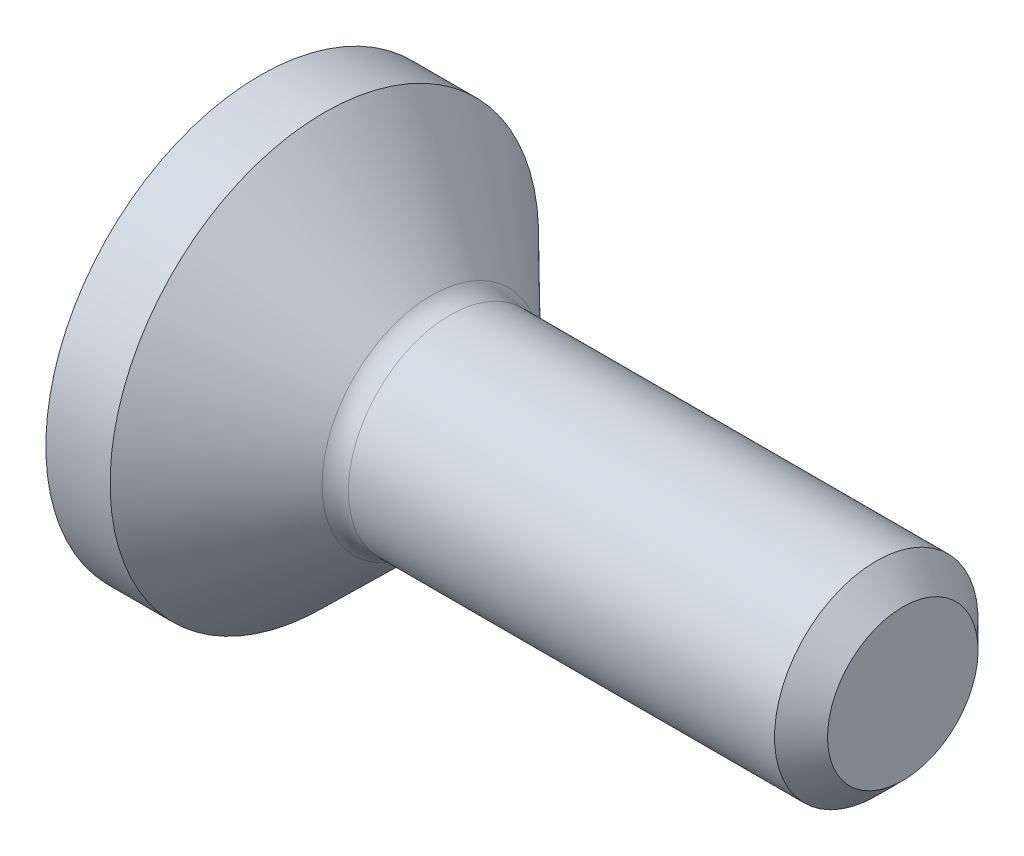
ISO-10303-21;
HEADER;
FILE_DESCRIPTION(('STEP AP214'),'2;1');
FILE_NAME('part.step','',(''),(''),'','','');
FILE_SCHEMA(('AUTOMOTIVE_DESIGN { 1 0 10303 214 1 1 1 1 }'));
ENDSEC;
DATA;
#1=APPLICATION_CONTEXT('core data for automotive mechanical design processes');
#2=APPLICATION_PROTOCOL_DEFINITION('international standard','automotive_design',2000,#1);
#3=PRODUCT_CONTEXT('',#1,'mechanical');
#4=PRODUCT('Part','Part','',(#3));
#5=PRODUCT_RELATED_PRODUCT_CATEGORY('part','',(#4));
#6=PRODUCT_DEFINITION_FORMATION('','',#4);
#7=PRODUCT_DEFINITION_CONTEXT('part definition',#1,'design');
#8=PRODUCT_DEFINITION('design','',#6,#7);
#9=PRODUCT_DEFINITION_SHAPE('','',#8);
#10=(LENGTH_UNIT() NAMED_UNIT(*) SI_UNIT(.MILLI.,.METRE.));
#11=(NAMED_UNIT(*) PLANE_ANGLE_UNIT() SI_UNIT($,.RADIAN.));
#12=(NAMED_UNIT(*) SI_UNIT($,.STERADIAN.) SOLID_ANGLE_UNIT());
#13=UNCERTAINTY_MEASURE_WITH_UNIT(LENGTH_MEASURE(1.E-05),#10,'distance_accuracy_value','');
#14=(GEOMETRIC_REPRESENTATION_CONTEXT(3) GLOBAL_UNCERTAINTY_ASSIGNED_CONTEXT((#13)) GLOBAL_UNIT_ASSIGNED_CONTEXT((#10,
#11,#12)) REPRESENTATION_CONTEXT('',''));
#15=CARTESIAN_POINT('',(0.,0.,0.));
#16=DIRECTION('',(0.,0.,1.));
#17=DIRECTION('',(1.,0.,0.));
#18=AXIS2_PLACEMENT_3D('',#15,#16,#17);
#19=CARTESIAN_POINT('',(1.77486105262841,0.,0.));
#20=DIRECTION('',(1.,0.,0.));
#21=DIRECTION('',(0.,1.,0.));
#22=AXIS2_PLACEMENT_3D('',#19,#20,#21);
#23=TOROIDAL_SURFACE('',#22,1.2,0.250000000000001);
#24=CARTESIAN_POINT('',(1.6,0.,0.));
#25=DIRECTION('',(1.,0.,0.));
#26=DIRECTION('',(0.,1.,0.));
#27=AXIS2_PLACEMENT_3D('',#24,#25,#26);
#28=CIRCLE('',#27,1.0213281995566);
#29=CARTESIAN_POINT('',(1.6,1.0213281995566,0.));
#30=VERTEX_POINT('',#29);
#31=EDGE_CURVE('E134',#30,#30,#28,.T.);
#32=ORIENTED_EDGE('',*,*,#31,.T.);
#33=EDGE_LOOP('',(#32));
#34=FACE_BOUND('',#33,.T.);
#35=CARTESIAN_POINT('',(1.77486105262841,0.,0.));
#36=DIRECTION('',(1.,0.,0.));
#37=DIRECTION('',(0.,1.,0.));
#38=AXIS2_PLACEMENT_3D('',#35,#36,#37);
#39=CIRCLE('',#38,0.950000000000001);
#40=CARTESIAN_POINT('',(1.77486105262841,0.950000000000001,0.));
#41=VERTEX_POINT('',#40);
#42=EDGE_CURVE('E11',#41,#41,#39,.T.);
#43=ORIENTED_EDGE('',*,*,#42,.F.);
#44=EDGE_LOOP('',(#43));
#45=FACE_BOUND('',#44,.T.);
#46=ADVANCED_FACE('F33',(#34,#45),#23,.F.);
#47=CARTESIAN_POINT('',(0.,0.,0.));
#48=DIRECTION('',(1.,0.,0.));
#49=DIRECTION('',(0.,1.,0.));
#50=AXIS2_PLACEMENT_3D('',#47,#48,#49);
#51=CYLINDRICAL_SURFACE('',#50,0.950000000000001);
#52=ORIENTED_EDGE('',*,*,#42,.T.);
#53=EDGE_LOOP('',(#52));
#54=FACE_BOUND('',#53,.T.);
#55=CARTESIAN_POINT('',(5.75251262658471,0.,0.));
#56=DIRECTION('',(1.,0.,0.));
#57=DIRECTION('',(0.,1.,0.));
#58=AXIS2_PLACEMENT_3D('',#55,#56,#57);
#59=CIRCLE('',#58,0.950000000000001);
#60=CARTESIAN_POINT('',(5.75251262658471,0.950000000000001,0.));
#61=VERTEX_POINT('',#60);
#62=EDGE_CURVE('E40',#61,#61,#59,.T.);
#63=ORIENTED_EDGE('',*,*,#62,.F.);
#64=EDGE_LOOP('',(#63));
#65=FACE_BOUND('',#64,.T.);
#66=ADVANCED_FACE('F156',(#54,#65),#51,.T.);
#67=CARTESIAN_POINT('',(6.,0.,0.));
#68=DIRECTION('',(-1.,0.,0.));
#69=DIRECTION('',(0.,-1.,0.));
#70=AXIS2_PLACEMENT_3D('',#67,#68,#69);
#71=CONICAL_SURFACE('',#70,0.702512626584708,0.785398163397451);
#72=ORIENTED_EDGE('',*,*,#62,.T.);
#73=EDGE_LOOP('',(#72));
#74=FACE_BOUND('',#73,.T.);
#75=CARTESIAN_POINT('',(6.,0.,0.));
#76=DIRECTION('',(1.,0.,0.));
#77=DIRECTION('',(0.,1.,0.));
#78=AXIS2_PLACEMENT_3D('',#75,#76,#77);
#79=CIRCLE('',#78,0.702512626584708);
#80=CARTESIAN_POINT('',(6.,0.702512626584708,0.));
#81=VERTEX_POINT('',#80);
#82=EDGE_CURVE('E148',#81,#81,#79,.T.);
#83=ORIENTED_EDGE('',*,*,#82,.F.);
#84=EDGE_LOOP('',(#83));
#85=FACE_BOUND('',#84,.T.);
#86=ADVANCED_FACE('F153',(#74,#85),#71,.T.);
#87=CARTESIAN_POINT('',(6.,0.702512626584708,0.));
#88=DIRECTION('',(1.,0.,0.));
#89=DIRECTION('',(0.,1.,0.));
#90=AXIS2_PLACEMENT_3D('',#87,#88,#89);
#91=PLANE('',#90);
#92=ORIENTED_EDGE('',*,*,#82,.T.);
#93=EDGE_LOOP('',(#92));
#94=FACE_BOUND('',#93,.T.);
#95=ADVANCED_FACE('F163',(#94),#91,.T.);
#96=CARTESIAN_POINT('',(0.,2.,0.));
#97=DIRECTION('',(-1.,0.,0.));
#98=DIRECTION('',(0.,-1.,0.));
#99=AXIS2_PLACEMENT_3D('',#96,#97,#98);
#100=PLANE('',#99);
#101=DIRECTION('',(0.,1.,0.));
#102=VECTOR('',#101,1.);
#103=CARTESIAN_POINT('',(0.,-0.43301270189222,0.75));
#104=LINE('',#103,#102);
#105=CARTESIAN_POINT('',(0.,-0.43301270189222,0.75));
#106=VERTEX_POINT('',#105);
#107=CARTESIAN_POINT('',(0.,0.43301270189222,0.75));
#108=VERTEX_POINT('',#107);
#109=EDGE_CURVE('E47',#106,#108,#104,.T.);
#110=ORIENTED_EDGE('',*,*,#109,.F.);
#111=DIRECTION('',(0.,0.5,0.866025403784439));
#112=VECTOR('',#111,1.);
#113=CARTESIAN_POINT('',(0.,-0.866025403784439,0.));
#114=LINE('',#113,#112);
#115=CARTESIAN_POINT('',(0.,-0.866025403784439,0.));
#116=VERTEX_POINT('',#115);
#117=EDGE_CURVE('E130',#116,#106,#114,.T.);
#118=ORIENTED_EDGE('',*,*,#117,.F.);
#119=DIRECTION('',(0.,-0.5,0.866025403784439));
#120=VECTOR('',#119,1.);
#121=CARTESIAN_POINT('',(0.,-0.43301270189222,-0.75));
#122=LINE('',#121,#120);
#123=CARTESIAN_POINT('',(0.,-0.43301270189222,-0.75));
#124=VERTEX_POINT('',#123);
#125=EDGE_CURVE('E128',#124,#116,#122,.T.);
#126=ORIENTED_EDGE('',*,*,#125,.F.);
#127=DIRECTION('',(0.,-1.,0.));
#128=VECTOR('',#127,1.);
#129=CARTESIAN_POINT('',(0.,0.43301270189222,-0.75));
#130=LINE('',#129,#128);
#131=CARTESIAN_POINT('',(0.,0.43301270189222,-0.75));
#132=VERTEX_POINT('',#131);
#133=EDGE_CURVE('E95',#132,#124,#130,.T.);
#134=ORIENTED_EDGE('',*,*,#133,.F.);
#135=DIRECTION('',(0.,-0.5,-0.866025403784439));
#136=VECTOR('',#135,1.);
#137=CARTESIAN_POINT('',(0.,0.866025403784439,0.));
#138=LINE('',#137,#136);
#139=CARTESIAN_POINT('',(0.,0.866025403784439,0.));
#140=VERTEX_POINT('',#139);
#141=EDGE_CURVE('E124',#140,#132,#138,.T.);
#142=ORIENTED_EDGE('',*,*,#141,.F.);
#143=DIRECTION('',(0.,0.5,-0.866025403784439));
#144=VECTOR('',#143,1.);
#145=CARTESIAN_POINT('',(0.,0.433012701892219,0.75));
#146=LINE('',#145,#144);
#147=EDGE_CURVE('E121',#108,#140,#146,.T.);
#148=ORIENTED_EDGE('',*,*,#147,.F.);
#149=EDGE_LOOP('',(#110,#118,#126,#134,#142,#148));
#150=FACE_BOUND('',#149,.T.);
#151=CARTESIAN_POINT('',(0.,0.,0.));
#152=DIRECTION('',(1.,0.,0.));
#153=DIRECTION('',(0.,1.,0.));
#154=AXIS2_PLACEMENT_3D('',#151,#152,#153);
#155=CIRCLE('',#154,2.);
#156=CARTESIAN_POINT('',(0.,2.,0.));
#157=VERTEX_POINT('',#156);
#158=EDGE_CURVE('E145',#157,#157,#155,.T.);
#159=ORIENTED_EDGE('',*,*,#158,.F.);
#160=EDGE_LOOP('',(#159));
#161=FACE_BOUND('',#160,.T.);
#162=ADVANCED_FACE('F169',(#150,#161),#100,.T.);
#163=CARTESIAN_POINT('',(0.,0.,0.));
#164=DIRECTION('',(1.,0.,0.));
#165=DIRECTION('',(0.,1.,0.));
#166=AXIS2_PLACEMENT_3D('',#163,#164,#165);
#167=CYLINDRICAL_SURFACE('',#166,2.);
#168=ORIENTED_EDGE('',*,*,#158,.T.);
#169=EDGE_LOOP('',(#168));
#170=FACE_BOUND('',#169,.T.);
#171=CARTESIAN_POINT('',(0.6,0.,0.));
#172=DIRECTION('',(1.,0.,0.));
#173=DIRECTION('',(0.,1.,0.));
#174=AXIS2_PLACEMENT_3D('',#171,#172,#173);
#175=CIRCLE('',#174,2.);
#176=CARTESIAN_POINT('',(0.6,2.,0.));
#177=VERTEX_POINT('',#176);
#178=EDGE_CURVE('E142',#177,#177,#175,.T.);
#179=ORIENTED_EDGE('',*,*,#178,.F.);
#180=EDGE_LOOP('',(#179));
#181=FACE_BOUND('',#180,.T.);
#182=ADVANCED_FACE('F173',(#170,#181),#167,.T.);
#183=CARTESIAN_POINT('',(1.6,0.,0.));
#184=DIRECTION('',(-1.,0.,0.));
#185=DIRECTION('',(0.,-1.,0.));
#186=AXIS2_PLACEMENT_3D('',#183,#184,#185);
#187=CONICAL_SURFACE('',#186,1.0213281995566,0.77461953220493);
#188=ORIENTED_EDGE('',*,*,#178,.T.);
#189=EDGE_LOOP('',(#188));
#190=FACE_BOUND('',#189,.T.);
#191=ORIENTED_EDGE('',*,*,#31,.F.);
#192=EDGE_LOOP('',(#191));
#193=FACE_BOUND('',#192,.T.);
#194=ADVANCED_FACE('F177',(#190,#193),#187,.T.);
#195=CARTESIAN_POINT('',(1.5,-0.43301270189222,0.75));
#196=DIRECTION('',(0.,0.,1.));
#197=DIRECTION('',(0.,-1.,0.));
#198=AXIS2_PLACEMENT_3D('',#195,#196,#197);
#199=PLANE('',#198);
#200=ORIENTED_EDGE('',*,*,#109,.T.);
#201=DIRECTION('',(-1.,0.,0.));
#202=VECTOR('',#201,1.);
#203=CARTESIAN_POINT('',(1.5,0.433012701892219,0.75));
#204=LINE('',#203,#202);
#205=CARTESIAN_POINT('',(1.5,0.433012701892219,0.75));
#206=VERTEX_POINT('',#205);
#207=EDGE_CURVE('E77',#206,#108,#204,.T.);
#208=ORIENTED_EDGE('',*,*,#207,.F.);
#209=DIRECTION('',(0.,1.,0.));
#210=VECTOR('',#209,1.);
#211=CARTESIAN_POINT('',(1.5,-0.43301270189222,0.75));
#212=LINE('',#211,#210);
#213=CARTESIAN_POINT('',(1.5,-0.43301270189222,0.75));
#214=VERTEX_POINT('',#213);
#215=EDGE_CURVE('E132',#214,#206,#212,.T.);
#216=ORIENTED_EDGE('',*,*,#215,.F.);
#217=DIRECTION('',(-1.,0.,0.));
#218=VECTOR('',#217,1.);
#219=CARTESIAN_POINT('',(1.5,-0.43301270189222,0.75));
#220=LINE('',#219,#218);
#221=EDGE_CURVE('E55',#214,#106,#220,.T.);
#222=ORIENTED_EDGE('',*,*,#221,.T.);
#223=EDGE_LOOP('',(#200,#208,#216,#222));
#224=FACE_BOUND('',#223,.T.);
#225=ADVANCED_FACE('F181',(#224),#199,.F.);
#226=CARTESIAN_POINT('',(1.5,-0.866025403784439,0.));
#227=DIRECTION('',(0.,-0.866025403784439,0.5));
#228=DIRECTION('',(0.,-0.5,-0.866025403784439));
#229=AXIS2_PLACEMENT_3D('',#226,#227,#228);
#230=PLANE('',#229);
#231=ORIENTED_EDGE('',*,*,#117,.T.);
#232=ORIENTED_EDGE('',*,*,#221,.F.);
#233=DIRECTION('',(0.,0.5,0.866025403784439));
#234=VECTOR('',#233,1.);
#235=CARTESIAN_POINT('',(1.5,-0.866025403784439,0.));
#236=LINE('',#235,#234);
#237=CARTESIAN_POINT('',(1.5,-0.866025403784439,0.));
#238=VERTEX_POINT('',#237);
#239=EDGE_CURVE('E107',#238,#214,#236,.T.);
#240=ORIENTED_EDGE('',*,*,#239,.F.);
#241=DIRECTION('',(-1.,0.,0.));
#242=VECTOR('',#241,1.);
#243=CARTESIAN_POINT('',(1.5,-0.866025403784439,0.));
#244=LINE('',#243,#242);
#245=EDGE_CURVE('E99',#238,#116,#244,.T.);
#246=ORIENTED_EDGE('',*,*,#245,.T.);
#247=EDGE_LOOP('',(#231,#232,#240,#246));
#248=FACE_BOUND('',#247,.T.);
#249=ADVANCED_FACE('F185',(#248),#230,.F.);
#250=CARTESIAN_POINT('',(1.5,-0.43301270189222,-0.75));
#251=DIRECTION('',(0.,-0.866025403784439,-0.5));
#252=DIRECTION('',(0.,0.5,-0.866025403784439));
#253=AXIS2_PLACEMENT_3D('',#250,#251,#252);
#254=PLANE('',#253);
#255=ORIENTED_EDGE('',*,*,#125,.T.);
#256=ORIENTED_EDGE('',*,*,#245,.F.);
#257=DIRECTION('',(0.,-0.5,0.866025403784439));
#258=VECTOR('',#257,1.);
#259=CARTESIAN_POINT('',(1.5,-0.43301270189222,-0.75));
#260=LINE('',#259,#258);
#261=CARTESIAN_POINT('',(1.5,-0.43301270189222,-0.75));
#262=VERTEX_POINT('',#261);
#263=EDGE_CURVE('E103',#262,#238,#260,.T.);
#264=ORIENTED_EDGE('',*,*,#263,.F.);
#265=DIRECTION('',(-1.,0.,0.));
#266=VECTOR('',#265,1.);
#267=CARTESIAN_POINT('',(1.5,-0.43301270189222,-0.75));
#268=LINE('',#267,#266);
#269=EDGE_CURVE('E88',#262,#124,#268,.T.);
#270=ORIENTED_EDGE('',*,*,#269,.T.);
#271=EDGE_LOOP('',(#255,#256,#264,#270));
#272=FACE_BOUND('',#271,.T.);
#273=ADVANCED_FACE('F104',(#272),#254,.F.);
#274=CARTESIAN_POINT('',(1.5,0.43301270189222,-0.75));
#275=DIRECTION('',(0.,0.,-1.));
#276=DIRECTION('',(0.,1.,0.));
#277=AXIS2_PLACEMENT_3D('',#274,#275,#276);
#278=PLANE('',#277);
#279=ORIENTED_EDGE('',*,*,#133,.T.);
#280=ORIENTED_EDGE('',*,*,#269,.F.);
#281=DIRECTION('',(0.,-1.,0.));
#282=VECTOR('',#281,1.);
#283=CARTESIAN_POINT('',(1.5,0.43301270189222,-0.75));
#284=LINE('',#283,#282);
#285=CARTESIAN_POINT('',(1.5,0.43301270189222,-0.75));
#286=VERTEX_POINT('',#285);
#287=EDGE_CURVE('E92',#286,#262,#284,.T.);
#288=ORIENTED_EDGE('',*,*,#287,.F.);
#289=DIRECTION('',(-1.,0.,0.));
#290=VECTOR('',#289,1.);
#291=CARTESIAN_POINT('',(1.5,0.43301270189222,-0.75));
#292=LINE('',#291,#290);
#293=EDGE_CURVE('E100',#286,#132,#292,.T.);
#294=ORIENTED_EDGE('',*,*,#293,.T.);
#295=EDGE_LOOP('',(#279,#280,#288,#294));
#296=FACE_BOUND('',#295,.T.);
#297=ADVANCED_FACE('F90',(#296),#278,.F.);
#298=CARTESIAN_POINT('',(1.5,0.866025403784439,0.));
#299=DIRECTION('',(0.,0.866025403784439,-0.5));
#300=DIRECTION('',(0.,0.5,0.866025403784439));
#301=AXIS2_PLACEMENT_3D('',#298,#299,#300);
#302=PLANE('',#301);
#303=ORIENTED_EDGE('',*,*,#141,.T.);
#304=ORIENTED_EDGE('',*,*,#293,.F.);
#305=DIRECTION('',(0.,-0.5,-0.866025403784439));
#306=VECTOR('',#305,1.);
#307=CARTESIAN_POINT('',(1.5,0.866025403784439,0.));
#308=LINE('',#307,#306);
#309=CARTESIAN_POINT('',(1.5,0.866025403784439,0.));
#310=VERTEX_POINT('',#309);
#311=EDGE_CURVE('E113',#310,#286,#308,.T.);
#312=ORIENTED_EDGE('',*,*,#311,.F.);
#313=DIRECTION('',(-1.,0.,0.));
#314=VECTOR('',#313,1.);
#315=CARTESIAN_POINT('',(1.5,0.866025403784439,0.));
#316=LINE('',#315,#314);
#317=EDGE_CURVE('E137',#310,#140,#316,.T.);
#318=ORIENTED_EDGE('',*,*,#317,.T.);
#319=EDGE_LOOP('',(#303,#304,#312,#318));
#320=FACE_BOUND('',#319,.T.);
#321=ADVANCED_FACE('F189',(#320),#302,.F.);
#322=CARTESIAN_POINT('',(1.5,0.433012701892219,0.75));
#323=DIRECTION('',(0.,0.866025403784438,0.5));
#324=DIRECTION('',(0.,-0.5,0.866025403784439));
#325=AXIS2_PLACEMENT_3D('',#322,#323,#324);
#326=PLANE('',#325);
#327=ORIENTED_EDGE('',*,*,#147,.T.);
#328=ORIENTED_EDGE('',*,*,#317,.F.);
#329=DIRECTION('',(0.,0.5,-0.866025403784439));
#330=VECTOR('',#329,1.);
#331=CARTESIAN_POINT('',(1.5,0.433012701892219,0.75));
#332=LINE('',#331,#330);
#333=EDGE_CURVE('E115',#206,#310,#332,.T.);
#334=ORIENTED_EDGE('',*,*,#333,.F.);
#335=ORIENTED_EDGE('',*,*,#207,.T.);
#336=EDGE_LOOP('',(#327,#328,#334,#335));
#337=FACE_BOUND('',#336,.T.);
#338=ADVANCED_FACE('F186',(#337),#326,.F.);
#339=CARTESIAN_POINT('',(1.5,0.,0.));
#340=DIRECTION('',(-1.,0.,0.));
#341=DIRECTION('',(0.,-1.,0.));
#342=AXIS2_PLACEMENT_3D('',#339,#340,#341);
#343=PLANE('',#342);
#344=ORIENTED_EDGE('',*,*,#215,.T.);
#345=ORIENTED_EDGE('',*,*,#333,.T.);
#346=ORIENTED_EDGE('',*,*,#311,.T.);
#347=ORIENTED_EDGE('',*,*,#287,.T.);
#348=ORIENTED_EDGE('',*,*,#263,.T.);
#349=ORIENTED_EDGE('',*,*,#239,.T.);
#350=EDGE_LOOP('',(#344,#345,#346,#347,#348,#349));
#351=FACE_BOUND('',#350,.T.);
#352=ADVANCED_FACE('F110',(#351),#343,.T.);
#353=CLOSED_SHELL('',(#46,#66,#86,#95,#162,#182,#194,#225,#249,#273,#297,#321,#338,#352));
#354=MANIFOLD_SOLID_BREP('B2',#353);
#355=ADVANCED_BREP_SHAPE_REPRESENTATION('',(#18,#354),#14);
#356=SHAPE_DEFINITION_REPRESENTATION(#9,#355);
ENDSEC;
END-ISO-10303-21;
